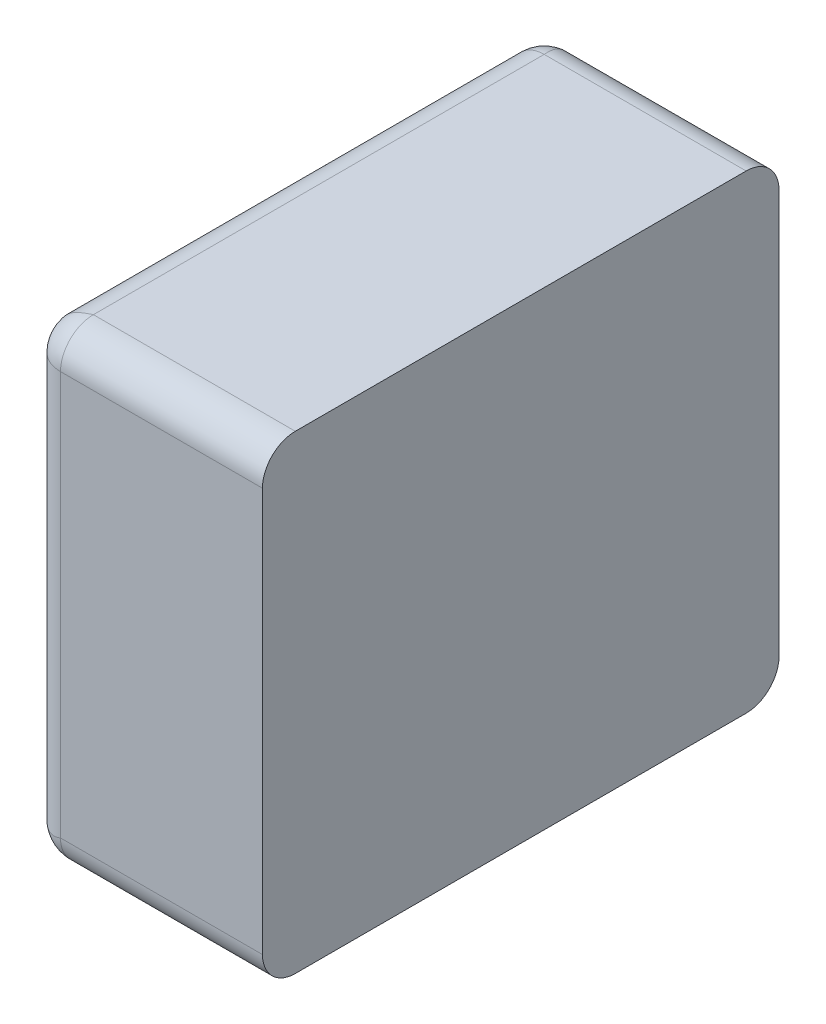
ISO-10303-21;
HEADER;
FILE_DESCRIPTION(('STEP AP214'),'2;1');
FILE_NAME('part.step','',(''),(''),'','','');
FILE_SCHEMA(('AUTOMOTIVE_DESIGN { 1 0 10303 214 1 1 1 1 }'));
ENDSEC;
DATA;
#1=APPLICATION_CONTEXT('core data for automotive mechanical design processes');
#2=APPLICATION_PROTOCOL_DEFINITION('international standard','automotive_design',2000,#1);
#3=PRODUCT_CONTEXT('',#1,'mechanical');
#4=PRODUCT('Part','Part','',(#3));
#5=PRODUCT_RELATED_PRODUCT_CATEGORY('part','',(#4));
#6=PRODUCT_DEFINITION_FORMATION('','',#4);
#7=PRODUCT_DEFINITION_CONTEXT('part definition',#1,'design');
#8=PRODUCT_DEFINITION('design','',#6,#7);
#9=PRODUCT_DEFINITION_SHAPE('','',#8);
#10=(LENGTH_UNIT() NAMED_UNIT(*) SI_UNIT(.MILLI.,.METRE.));
#11=(NAMED_UNIT(*) PLANE_ANGLE_UNIT() SI_UNIT($,.RADIAN.));
#12=(NAMED_UNIT(*) SI_UNIT($,.STERADIAN.) SOLID_ANGLE_UNIT());
#13=UNCERTAINTY_MEASURE_WITH_UNIT(LENGTH_MEASURE(1.E-05),#10,'distance_accuracy_value','');
#14=(GEOMETRIC_REPRESENTATION_CONTEXT(3) GLOBAL_UNCERTAINTY_ASSIGNED_CONTEXT((#13)) GLOBAL_UNIT_ASSIGNED_CONTEXT((#10,
#11,#12)) REPRESENTATION_CONTEXT('',''));
#15=CARTESIAN_POINT('',(0.,0.,0.));
#16=DIRECTION('',(0.,0.,1.));
#17=DIRECTION('',(1.,0.,0.));
#18=AXIS2_PLACEMENT_3D('',#15,#16,#17);
#19=CARTESIAN_POINT('',(-0.465,-0.215,0.035));
#20=DIRECTION('',(0.408248290463862,0.408248290463862,-0.816496580927727));
#21=DIRECTION('',(-0.577350269189627,-0.577350269189626,-0.577350269189624));
#22=AXIS2_PLACEMENT_3D('',#19,#20,#21);
#23=SPHERICAL_SURFACE('',#22,0.035);
#24=CARTESIAN_POINT('',(-0.465,-0.215,0.035));
#25=DIRECTION('',(0.,0.,-1.));
#26=DIRECTION('',(-1.,0.,0.));
#27=AXIS2_PLACEMENT_3D('',#24,#25,#26);
#28=CIRCLE('',#27,0.035);
#29=CARTESIAN_POINT('',(-0.465,-0.25,0.035));
#30=VERTEX_POINT('',#29);
#31=CARTESIAN_POINT('',(-0.5,-0.215,0.035));
#32=VERTEX_POINT('',#31);
#33=EDGE_CURVE('E11',#30,#32,#28,.T.);
#34=ORIENTED_EDGE('',*,*,#33,.T.);
#35=CARTESIAN_POINT('',(-0.465,-0.215,0.035));
#36=DIRECTION('',(0.,-1.,0.));
#37=DIRECTION('',(0.,0.,-1.));
#38=AXIS2_PLACEMENT_3D('',#35,#36,#37);
#39=CIRCLE('',#38,0.035);
#40=CARTESIAN_POINT('',(-0.465,-0.215,0.));
#41=VERTEX_POINT('',#40);
#42=EDGE_CURVE('E25',#32,#41,#39,.T.);
#43=ORIENTED_EDGE('',*,*,#42,.T.);
#44=CARTESIAN_POINT('',(-0.465,-0.215,0.));
#45=CARTESIAN_POINT('',(-0.465111612711924,-0.215243740660052,-1.03313121788324E-09));
#46=CARTESIAN_POINT('',(-0.465220629481718,-0.215488666732516,3.07994713752404E-06));
#47=CARTESIAN_POINT('',(-0.465433885748775,-0.215981520070315,1.54213448005007E-05));
#48=CARTESIAN_POINT('',(-0.465538105940278,-0.216229455116116,2.47047353632996E-05));
#49=CARTESIAN_POINT('',(-0.465741732728677,-0.216728068059787,4.95126755131809E-05));
#50=CARTESIAN_POINT('',(-0.465841119852847,-0.216978752749827,6.5060450524553E-05));
#51=CARTESIAN_POINT('',(-0.466035053958947,-0.217482605532488,0.000102452445534109));
#52=CARTESIAN_POINT('',(-0.466129581379983,-0.217735779413988,0.000124320072643491));
#53=CARTESIAN_POINT('',(-0.466313776392918,-0.218244348899178,0.00017440254172946));
#54=CARTESIAN_POINT('',(-0.466403424402808,-0.218499749275707,0.000202640909732528));
#55=CARTESIAN_POINT('',(-0.466577848292495,-0.219012507395305,0.000265510172820462));
#56=CARTESIAN_POINT('',(-0.466662604636929,-0.219269868886962,0.000300164647462443));
#57=CARTESIAN_POINT('',(-0.466827241108787,-0.219786286919367,0.000375907162554592));
#58=CARTESIAN_POINT('',(-0.466907101816688,-0.220045346199856,0.000417018776369786));
#59=CARTESIAN_POINT('',(-0.467061947217244,-0.220564882823023,0.000505707891539696));
#60=CARTESIAN_POINT('',(-0.467136912658727,-0.220825361855251,0.000553308885241232));
#61=CARTESIAN_POINT('',(-0.467354908381942,-0.221609968604591,0.000706139736048346));
#62=CARTESIAN_POINT('',(-0.467490140608452,-0.222134442299266,0.000820984013978112));
#63=CARTESIAN_POINT('',(-0.467741374273634,-0.223185841676211,0.0010767387258538));
#64=CARTESIAN_POINT('',(-0.467857228778892,-0.223712757469804,0.00121783256577717));
#65=CARTESIAN_POINT('',(-0.468070002263369,-0.224766949596737,0.00152617607159482));
#66=CARTESIAN_POINT('',(-0.468166781309575,-0.225294202048866,0.00169360392114075));
#67=CARTESIAN_POINT('',(-0.468341794125163,-0.226346926690304,0.00205460359238605));
#68=CARTESIAN_POINT('',(-0.468419896278803,-0.226872361926918,0.00224834669154829));
#69=CARTESIAN_POINT('',(-0.468558060079502,-0.227919345661508,0.00266187397459508));
#70=CARTESIAN_POINT('',(-0.468617999653095,-0.228440845843563,0.00288182110244223));
#71=CARTESIAN_POINT('',(-0.468720448187068,-0.229477876626666,0.00334755767046511));
#72=CARTESIAN_POINT('',(-0.468762845535282,-0.229993349320268,0.00359350045178805));
#73=CARTESIAN_POINT('',(-0.468830922361839,-0.231016280639682,0.00411093349099743));
#74=CARTESIAN_POINT('',(-0.468856501350634,-0.23152367372897,0.00438256641507604));
#75=CARTESIAN_POINT('',(-0.468891752157373,-0.232528447342334,0.00495098793051568));
#76=CARTESIAN_POINT('',(-0.468901334999283,-0.233025756761079,0.00524790763666658));
#77=CARTESIAN_POINT('',(-0.468905497314477,-0.234008419811665,0.00586641376765002));
#78=CARTESIAN_POINT('',(-0.468899999455456,-0.234493698895198,0.00618811908026279));
#79=CARTESIAN_POINT('',(-0.468874991771525,-0.235450421844009,0.00685561052472573));
#80=CARTESIAN_POINT('',(-0.468855416137075,-0.235921789865429,0.00720150284269199));
#81=CARTESIAN_POINT('',(-0.468803325972781,-0.236848883390665,0.00791668610202663));
#82=CARTESIAN_POINT('',(-0.468770756798167,-0.237304533887315,0.00828607025275676));
#83=CARTESIAN_POINT('',(-0.468693827906318,-0.238198465147439,0.00904745977856767));
#84=CARTESIAN_POINT('',(-0.468649424130771,-0.238636673823173,0.0094395453073941));
#85=CARTESIAN_POINT('',(-0.468550042880493,-0.239494081877566,0.0102454665261899));
#86=CARTESIAN_POINT('',(-0.46849503115435,-0.239913214090433,0.010659369426859));
#87=CARTESIAN_POINT('',(-0.468375712170395,-0.240730924439449,0.0115079626417149));
#88=CARTESIAN_POINT('',(-0.468311379508136,-0.24112944222653,0.0119427075214746));
#89=CARTESIAN_POINT('',(-0.468174750640235,-0.241904480393031,0.0128319326780499));
#90=CARTESIAN_POINT('',(-0.468102436759082,-0.242280949002712,0.0132864553513876));
#91=CARTESIAN_POINT('',(-0.467951223461324,-0.243010553093937,0.0142140976534304));
#92=CARTESIAN_POINT('',(-0.467872312845424,-0.243363646993975,0.0146872481556479));
#93=CARTESIAN_POINT('',(-0.467709322047743,-0.24404527918449,0.0156509245104299));
#94=CARTESIAN_POINT('',(-0.467625235779704,-0.244373787518085,0.0161414705203753));
#95=CARTESIAN_POINT('',(-0.46745333933637,-0.245005144400936,0.0171386367904849));
#96=CARTESIAN_POINT('',(-0.46736552673908,-0.245307975865549,0.017645267449571));
#97=CARTESIAN_POINT('',(-0.467187644541206,-0.245886997623915,0.0186732264837271));
#98=CARTESIAN_POINT('',(-0.46709757467388,-0.246163184750225,0.0191945565967516));
#99=CARTESIAN_POINT('',(-0.466916657514606,-0.246688063108948,0.0202504670074886));
#100=CARTESIAN_POINT('',(-0.466825810567597,-0.246936765921816,0.020785041607539));
#101=CARTESIAN_POINT('',(-0.466644822850269,-0.247405950840186,0.0218659272634811));
#102=CARTESIAN_POINT('',(-0.466554681484352,-0.247626459881027,0.0224122265262787));
#103=CARTESIAN_POINT('',(-0.466376583863148,-0.248038664969825,0.0235149867097744));
#104=CARTESIAN_POINT('',(-0.466288624536903,-0.248230403683926,0.0240714311827869));
#105=CARTESIAN_POINT('',(-0.466116356585997,-0.248584610279058,0.0251928514102044));
#106=CARTESIAN_POINT('',(-0.466032040923638,-0.248747136696717,0.0257578075882802));
#107=CARTESIAN_POINT('',(-0.465868503907326,-0.249042596740997,0.0268945709012228));
#108=CARTESIAN_POINT('',(-0.465789270127003,-0.249175604674644,0.0274663569255934));
#109=CARTESIAN_POINT('',(-0.465637310030175,-0.249411841774386,0.0286150561499456));
#110=CARTESIAN_POINT('',(-0.465564564571695,-0.249515160678849,0.0291919483482462));
#111=CARTESIAN_POINT('',(-0.465426955223335,-0.24969197165179,0.030349097243533));
#112=CARTESIAN_POINT('',(-0.46536206427015,-0.249765568305483,0.0309293347257463));
#113=CARTESIAN_POINT('',(-0.465241491601007,-0.249883016607641,0.0320913854999231));
#114=CARTESIAN_POINT('',(-0.465185773836936,-0.249926986895526,0.0326731830258738));
#115=CARTESIAN_POINT('',(-0.46508481781809,-0.249985419922284,0.0338365222126201));
#116=CARTESIAN_POINT('',(-0.465039533648617,-0.250000014219777,0.034418053300633));
#117=CARTESIAN_POINT('',(-0.465,-0.25,0.035));
#118=B_SPLINE_CURVE_WITH_KNOTS('',3,(#44,#45,#46,#47,#48,#49,#50,#51,#52,#53,#54,#55,#56,#57,
#58,#59,#60,#61,#62,#63,#64,#65,#66,#67,#68,#69,#70,#71,#72,#73,#74,#75,#76,#77,#78,#79,#80,#81,
#82,#83,#84,#85,#86,#87,#88,#89,#90,#91,#92,#93,#94,#95,#96,#97,#98,#99,#100,#101,#102,#103,
#104,#105,#106,#107,#108,#109,#110,#111,#112,#113,#114,#115,#116,#117),.UNSPECIFIED.,.F.,.F.,(4,
2,2,2,2,2,2,2,2,2,2,2,2,2,2,2,2,2,2,2,2,2,2,2,2,2,2,2,2,2,2,2,2,2,2,2,4),(0.,
0.000804202894423743,0.00161140112012554,0.00242162001218123,0.00323487907148141,
0.00405119199335701,0.00487056670714094,0.00569300542608973,0.00651850470709532,
0.0081784637161977,0.00985048891785636,0.0115343571056827,0.0132297631362427,0.0149363236396878,
0.0166535810697015,0.0183810080428296,0.0201180119227882,0.0218639396106708,0.0236180825069812,
0.0253796816160158,0.027147932767272,0.0289219919322403,0.0307009806181439,0.0324839913229419,
0.034270093038217,0.0360583367884569,0.0378477611967303,0.0396373980678723,0.041426277981054,
0.0432134358840201,0.0449979166813543,0.0467787808088675,0.0485551097856008,0.0503260117339757,
0.0520906268573044,0.0538481328621556,0.0555977503109577),.UNSPECIFIED.);
#119=EDGE_CURVE('E108',#41,#30,#118,.T.);
#120=ORIENTED_EDGE('',*,*,#119,.T.);
#121=EDGE_LOOP('',(#34,#43,#120));
#122=FACE_BOUND('',#121,.T.);
#123=ADVANCED_FACE('F17',(#122),#23,.T.);
#124=CARTESIAN_POINT('',(-0.465,0.215,0.035));
#125=DIRECTION('',(0.408248290463863,-0.408248290463862,-0.816496580927727));
#126=DIRECTION('',(-0.577350269189628,0.577350269189625,-0.577350269189625));
#127=AXIS2_PLACEMENT_3D('',#124,#125,#126);
#128=SPHERICAL_SURFACE('',#127,0.035);
#129=CARTESIAN_POINT('',(-0.465,0.215,0.035));
#130=DIRECTION('',(0.,0.,-1.));
#131=DIRECTION('',(0.,1.,0.));
#132=AXIS2_PLACEMENT_3D('',#129,#130,#131);
#133=CIRCLE('',#132,0.035);
#134=CARTESIAN_POINT('',(-0.5,0.215,0.035));
#135=VERTEX_POINT('',#134);
#136=CARTESIAN_POINT('',(-0.465,0.25,0.035));
#137=VERTEX_POINT('',#136);
#138=EDGE_CURVE('E303',#135,#137,#133,.T.);
#139=ORIENTED_EDGE('',*,*,#138,.T.);
#140=CARTESIAN_POINT('',(-0.465,0.25,0.035));
#141=CARTESIAN_POINT('',(-0.465039533648617,0.250000014219777,0.034418053300633));
#142=CARTESIAN_POINT('',(-0.46508481781809,0.249985419922284,0.0338365222126201));
#143=CARTESIAN_POINT('',(-0.465185773836936,0.249926986895526,0.0326731830258739));
#144=CARTESIAN_POINT('',(-0.465241491601008,0.249883016607641,0.0320913854999232));
#145=CARTESIAN_POINT('',(-0.465362064270151,0.249765568305483,0.0309293347257464));
#146=CARTESIAN_POINT('',(-0.465426955223335,0.24969197165179,0.0303490972435331));
#147=CARTESIAN_POINT('',(-0.465564564571695,0.249515160678849,0.0291919483482462));
#148=CARTESIAN_POINT('',(-0.465637310030175,0.249411841774386,0.0286150561499456));
#149=CARTESIAN_POINT('',(-0.465789270127004,0.249175604674644,0.0274663569255934));
#150=CARTESIAN_POINT('',(-0.465868503907326,0.249042596740997,0.0268945709012228));
#151=CARTESIAN_POINT('',(-0.466032040923638,0.248747136696717,0.0257578075882802));
#152=CARTESIAN_POINT('',(-0.466116356585997,0.248584610279058,0.0251928514102044));
#153=CARTESIAN_POINT('',(-0.466288624536903,0.248230403683926,0.0240714311827869));
#154=CARTESIAN_POINT('',(-0.466376583863148,0.248038664969825,0.0235149867097744));
#155=CARTESIAN_POINT('',(-0.466554681484352,0.247626459881026,0.0224122265262787));
#156=CARTESIAN_POINT('',(-0.466644822850269,0.247405950840186,0.0218659272634811));
#157=CARTESIAN_POINT('',(-0.466825810567597,0.246936765921816,0.020785041607539));
#158=CARTESIAN_POINT('',(-0.466916657514606,0.246688063108949,0.0202504670074887));
#159=CARTESIAN_POINT('',(-0.46709757467388,0.246163184750225,0.0191945565967516));
#160=CARTESIAN_POINT('',(-0.467187644541206,0.245886997623915,0.0186732264837271));
#161=CARTESIAN_POINT('',(-0.46736552673908,0.245307975865549,0.0176452674495711));
#162=CARTESIAN_POINT('',(-0.46745333933637,0.245005144400936,0.0171386367904849));
#163=CARTESIAN_POINT('',(-0.467625235779704,0.244373787518085,0.0161414705203753));
#164=CARTESIAN_POINT('',(-0.467709322047744,0.24404527918449,0.0156509245104299));
#165=CARTESIAN_POINT('',(-0.467872312845424,0.243363646993975,0.0146872481556479));
#166=CARTESIAN_POINT('',(-0.467951223461324,0.243010553093937,0.0142140976534304));
#167=CARTESIAN_POINT('',(-0.468102436759082,0.242280949002712,0.0132864553513876));
#168=CARTESIAN_POINT('',(-0.468174750640235,0.241904480393031,0.0128319326780499));
#169=CARTESIAN_POINT('',(-0.468311379508136,0.24112944222653,0.0119427075214746));
#170=CARTESIAN_POINT('',(-0.468375712170396,0.240730924439448,0.0115079626417148));
#171=CARTESIAN_POINT('',(-0.46849503115435,0.239913214090433,0.010659369426859));
#172=CARTESIAN_POINT('',(-0.468550042880493,0.239494081877566,0.0102454665261898));
#173=CARTESIAN_POINT('',(-0.468649424130772,0.238636673823173,0.00943954530739408));
#174=CARTESIAN_POINT('',(-0.468693827906318,0.238198465147439,0.00904745977856765));
#175=CARTESIAN_POINT('',(-0.468770756798168,0.237304533887315,0.00828607025275674));
#176=CARTESIAN_POINT('',(-0.468803325972781,0.236848883390665,0.00791668610202661));
#177=CARTESIAN_POINT('',(-0.468855416137075,0.235921789865429,0.00720150284269198));
#178=CARTESIAN_POINT('',(-0.468874991771525,0.235450421844009,0.00685561052472571));
#179=CARTESIAN_POINT('',(-0.468899999455456,0.234493698895198,0.00618811908026278));
#180=CARTESIAN_POINT('',(-0.468905497314477,0.234008419811665,0.00586641376765001));
#181=CARTESIAN_POINT('',(-0.468901334999283,0.233025756761079,0.00524790763666659));
#182=CARTESIAN_POINT('',(-0.468891752157373,0.232528447342334,0.0049509879305157));
#183=CARTESIAN_POINT('',(-0.468856501350634,0.23152367372897,0.00438256641507606));
#184=CARTESIAN_POINT('',(-0.468830922361839,0.231016280639683,0.00411093349099744));
#185=CARTESIAN_POINT('',(-0.468762845535282,0.229993349320268,0.00359350045178806));
#186=CARTESIAN_POINT('',(-0.468720448187068,0.229477876626666,0.00334755767046512));
#187=CARTESIAN_POINT('',(-0.468617999653095,0.228440845843563,0.00288182110244223));
#188=CARTESIAN_POINT('',(-0.468558060079502,0.227919345661508,0.00266187397459508));
#189=CARTESIAN_POINT('',(-0.468419896278803,0.226872361926918,0.00224834669154829));
#190=CARTESIAN_POINT('',(-0.468341794125163,0.226346926690304,0.00205460359238605));
#191=CARTESIAN_POINT('',(-0.468166781309575,0.225294202048866,0.00169360392114074));
#192=CARTESIAN_POINT('',(-0.468070002263369,0.224766949596737,0.0015261760715948));
#193=CARTESIAN_POINT('',(-0.467857228778892,0.223712757469804,0.00121783256577715));
#194=CARTESIAN_POINT('',(-0.467741374273634,0.223185841676211,0.0010767387258538));
#195=CARTESIAN_POINT('',(-0.467490140608452,0.222134442299266,0.000820984013978118));
#196=CARTESIAN_POINT('',(-0.467354908381942,0.221609968604591,0.000706139736048343));
#197=CARTESIAN_POINT('',(-0.467136912658727,0.220825361855251,0.000553308885241231));
#198=CARTESIAN_POINT('',(-0.467061947217244,0.220564882823023,0.000505707891539698));
#199=CARTESIAN_POINT('',(-0.466907101816688,0.220045346199856,0.000417018776369788));
#200=CARTESIAN_POINT('',(-0.466827241108787,0.219786286919367,0.000375907162554591));
#201=CARTESIAN_POINT('',(-0.466662604636929,0.219269868886962,0.000300164647462441));
#202=CARTESIAN_POINT('',(-0.466577848292495,0.219012507395305,0.000265510172820461));
#203=CARTESIAN_POINT('',(-0.466403424402808,0.218499749275707,0.000202640909732528));
#204=CARTESIAN_POINT('',(-0.466313776392918,0.218244348899178,0.000174402541729461));
#205=CARTESIAN_POINT('',(-0.466129581379983,0.217735779413988,0.000124320072643491));
#206=CARTESIAN_POINT('',(-0.466035053958947,0.217482605532488,0.000102452445534108));
#207=CARTESIAN_POINT('',(-0.465841119852847,0.216978752749827,6.50604505245525E-05));
#208=CARTESIAN_POINT('',(-0.465741732728677,0.216728068059787,4.9512675513182E-05));
#209=CARTESIAN_POINT('',(-0.465538105940278,0.216229455116116,2.47047353632983E-05));
#210=CARTESIAN_POINT('',(-0.465433885748775,0.215981520070315,1.54213448004956E-05));
#211=CARTESIAN_POINT('',(-0.465220629481718,0.215488666732516,3.07994713751589E-06));
#212=CARTESIAN_POINT('',(-0.465111612711924,0.215243740660052,-1.03313122539466E-09));
#213=CARTESIAN_POINT('',(-0.465,0.215,0.));
#214=B_SPLINE_CURVE_WITH_KNOTS('',3,(#140,#141,#142,#143,#144,#145,#146,#147,#148,#149,#150,
#151,#152,#153,#154,#155,#156,#157,#158,#159,#160,#161,#162,#163,#164,#165,#166,#167,#168,#169,
#170,#171,#172,#173,#174,#175,#176,#177,#178,#179,#180,#181,#182,#183,#184,#185,#186,#187,#188,
#189,#190,#191,#192,#193,#194,#195,#196,#197,#198,#199,#200,#201,#202,#203,#204,#205,#206,#207,
#208,#209,#210,#211,#212,#213),.UNSPECIFIED.,.F.,.F.,(4,2,2,2,2,2,2,2,2,2,2,2,2,2,2,2,2,2,2,2,2,
2,2,2,2,2,2,2,2,2,2,2,2,2,2,2,4),(0.,0.00174961744880199,0.00350712345365322,0.0052717385769819,
0.00704264052535691,0.00881896950209018,0.0105998336296034,0.0123843144269376,
0.0141714723299037,0.0159603522430853,0.0177499891142273,0.0195394135225007,0.0213276572727407,
0.0231137589880158,0.0248967696928138,0.0266757583787174,0.0284498175436857,0.0302180686949419,
0.0319796678039765,0.0337338107002869,0.0354797383881695,0.037216742268128,0.0389441692412561,
0.0406614266712698,0.042367987174715,0.044063393205275,0.0457472613931014,0.04741928659476,
0.0490792456038624,0.049904744884868,0.0507271836038167,0.0515465583176006,0.0523628712394762,
0.0531761302987764,0.0539863491908321,0.0547935474165339,0.0555977503109577),.UNSPECIFIED.);
#215=CARTESIAN_POINT('',(-0.465,0.215,0.));
#216=VERTEX_POINT('',#215);
#217=EDGE_CURVE('E287',#137,#216,#214,.T.);
#218=ORIENTED_EDGE('',*,*,#217,.T.);
#219=CARTESIAN_POINT('',(-0.465,0.215,0.035));
#220=DIRECTION('',(0.,1.,0.));
#221=DIRECTION('',(-1.,0.,0.));
#222=AXIS2_PLACEMENT_3D('',#219,#220,#221);
#223=CIRCLE('',#222,0.0350000000000001);
#224=EDGE_CURVE('E277',#216,#135,#223,.T.);
#225=ORIENTED_EDGE('',*,*,#224,.T.);
#226=EDGE_LOOP('',(#139,#218,#225));
#227=FACE_BOUND('',#226,.T.);
#228=ADVANCED_FACE('F269',(#227),#128,.T.);
#229=CARTESIAN_POINT('',(-0.3125,0.215,0.035));
#230=DIRECTION('',(-1.,0.,0.));
#231=DIRECTION('',(0.,0.707106781186548,-0.707106781186547));
#232=AXIS2_PLACEMENT_3D('',#229,#230,#231);
#233=CYLINDRICAL_SURFACE('',#232,0.035);
#234=CARTESIAN_POINT('',(-0.25,0.215,0.035));
#235=DIRECTION('',(-1.,0.,0.));
#236=DIRECTION('',(0.,0.707106781186548,-0.707106781186547));
#237=AXIS2_PLACEMENT_3D('',#234,#235,#236);
#238=CIRCLE('',#237,0.035);
#239=CARTESIAN_POINT('',(-0.25,0.25,0.035));
#240=VERTEX_POINT('',#239);
#241=CARTESIAN_POINT('',(-0.25,0.215,0.));
#242=VERTEX_POINT('',#241);
#243=EDGE_CURVE('E343',#240,#242,#238,.T.);
#244=ORIENTED_EDGE('',*,*,#243,.T.);
#245=DIRECTION('',(-1.,0.,0.));
#246=VECTOR('',#245,1.);
#247=CARTESIAN_POINT('',(-0.3125,0.215,0.));
#248=LINE('',#247,#246);
#249=EDGE_CURVE('E118',#242,#216,#248,.T.);
#250=ORIENTED_EDGE('',*,*,#249,.T.);
#251=ORIENTED_EDGE('',*,*,#217,.F.);
#252=DIRECTION('',(1.,0.,0.));
#253=VECTOR('',#252,1.);
#254=CARTESIAN_POINT('',(-0.3125,0.25,0.035));
#255=LINE('',#254,#253);
#256=EDGE_CURVE('E340',#137,#240,#255,.T.);
#257=ORIENTED_EDGE('',*,*,#256,.T.);
#258=EDGE_LOOP('',(#244,#250,#251,#257));
#259=FACE_BOUND('',#258,.T.);
#260=ADVANCED_FACE('F265',(#259),#233,.T.);
#261=CARTESIAN_POINT('',(-0.465,0.125,0.035));
#262=DIRECTION('',(0.,-1.,0.));
#263=DIRECTION('',(-0.707106781186549,0.,-0.707106781186546));
#264=AXIS2_PLACEMENT_3D('',#261,#262,#263);
#265=CYLINDRICAL_SURFACE('',#264,0.035);
#266=ORIENTED_EDGE('',*,*,#42,.F.);
#267=DIRECTION('',(0.,1.,0.));
#268=VECTOR('',#267,1.);
#269=CARTESIAN_POINT('',(-0.5,0.125,0.035));
#270=LINE('',#269,#268);
#271=EDGE_CURVE('E345',#32,#135,#270,.T.);
#272=ORIENTED_EDGE('',*,*,#271,.T.);
#273=ORIENTED_EDGE('',*,*,#224,.F.);
#274=DIRECTION('',(0.,-1.,0.));
#275=VECTOR('',#274,1.);
#276=CARTESIAN_POINT('',(-0.465,0.125,0.));
#277=LINE('',#276,#275);
#278=EDGE_CURVE('E348',#216,#41,#277,.T.);
#279=ORIENTED_EDGE('',*,*,#278,.T.);
#280=EDGE_LOOP('',(#266,#272,#273,#279));
#281=FACE_BOUND('',#280,.T.);
#282=ADVANCED_FACE('F261',(#281),#265,.T.);
#283=CARTESIAN_POINT('',(-0.465,-0.215,0.515));
#284=DIRECTION('',(-0.408248290463864,-0.408248290463862,-0.816496580927726));
#285=DIRECTION('',(-0.577350269189626,-0.577350269189625,0.577350269189626));
#286=AXIS2_PLACEMENT_3D('',#283,#284,#285);
#287=SPHERICAL_SURFACE('',#286,0.035);
#288=CARTESIAN_POINT('',(-0.465,-0.215,0.55));
#289=CARTESIAN_POINT('',(-0.465243740660053,-0.215111612711924,0.550000001033131));
#290=CARTESIAN_POINT('',(-0.465488666732516,-0.215220629481718,0.549996920052863));
#291=CARTESIAN_POINT('',(-0.465981520070315,-0.215433885748775,0.5499845786552));
#292=CARTESIAN_POINT('',(-0.466229455116116,-0.215538105940278,0.549975295264637));
#293=CARTESIAN_POINT('',(-0.466728068059787,-0.215741732728677,0.549950487324487));
#294=CARTESIAN_POINT('',(-0.466978752749827,-0.215841119852847,0.549934939549475));
#295=CARTESIAN_POINT('',(-0.467482605532488,-0.216035053958947,0.549897547554466));
#296=CARTESIAN_POINT('',(-0.467735779413988,-0.216129581379983,0.549875679927357));
#297=CARTESIAN_POINT('',(-0.468244348899179,-0.216313776392918,0.549825597458271));
#298=CARTESIAN_POINT('',(-0.468499749275707,-0.216403424402807,0.549797359090268));
#299=CARTESIAN_POINT('',(-0.469012507395305,-0.216577848292495,0.54973448982718));
#300=CARTESIAN_POINT('',(-0.469269868886963,-0.216662604636929,0.549699835352538));
#301=CARTESIAN_POINT('',(-0.469786286919367,-0.216827241108787,0.549624092837446));
#302=CARTESIAN_POINT('',(-0.470045346199856,-0.216907101816688,0.54958298122363));
#303=CARTESIAN_POINT('',(-0.470564882823023,-0.217061947217244,0.54949429210846));
#304=CARTESIAN_POINT('',(-0.470825361855251,-0.217136912658727,0.549446691114759));
#305=CARTESIAN_POINT('',(-0.471609968604591,-0.217354908381942,0.549293860263952));
#306=CARTESIAN_POINT('',(-0.472134442299266,-0.217490140608452,0.549179015986022));
#307=CARTESIAN_POINT('',(-0.473185841676211,-0.217741374273634,0.548923261274146));
#308=CARTESIAN_POINT('',(-0.473712757469804,-0.217857228778892,0.548782167434223));
#309=CARTESIAN_POINT('',(-0.474766949596737,-0.218070002263369,0.548473823928405));
#310=CARTESIAN_POINT('',(-0.475294202048866,-0.218166781309575,0.548306396078859));
#311=CARTESIAN_POINT('',(-0.476346926690304,-0.218341794125163,0.547945396407614));
#312=CARTESIAN_POINT('',(-0.476872361926918,-0.218419896278802,0.547751653308452));
#313=CARTESIAN_POINT('',(-0.477919345661508,-0.218558060079502,0.547338126025405));
#314=CARTESIAN_POINT('',(-0.478440845843563,-0.218617999653095,0.547118178897558));
#315=CARTESIAN_POINT('',(-0.479477876626667,-0.218720448187068,0.546652442329535));
#316=CARTESIAN_POINT('',(-0.479993349320268,-0.218762845535282,0.546406499548212));
#317=CARTESIAN_POINT('',(-0.481016280639683,-0.218830922361839,0.545889066509003));
#318=CARTESIAN_POINT('',(-0.48152367372897,-0.218856501350634,0.545617433584924));
#319=CARTESIAN_POINT('',(-0.482528447342334,-0.218891752157372,0.545049012069484));
#320=CARTESIAN_POINT('',(-0.483025756761079,-0.218901334999283,0.544752092363333));
#321=CARTESIAN_POINT('',(-0.484008419811665,-0.218905497314477,0.54413358623235));
#322=CARTESIAN_POINT('',(-0.484493698895198,-0.218899999455456,0.543811880919737));
#323=CARTESIAN_POINT('',(-0.485450421844009,-0.218874991771525,0.543144389475274));
#324=CARTESIAN_POINT('',(-0.485921789865429,-0.218855416137075,0.542798497157308));
#325=CARTESIAN_POINT('',(-0.486848883390665,-0.218803325972781,0.542083313897973));
#326=CARTESIAN_POINT('',(-0.487304533887315,-0.218770756798167,0.541713929747243));
#327=CARTESIAN_POINT('',(-0.488198465147439,-0.218693827906318,0.540952540221432));
#328=CARTESIAN_POINT('',(-0.488636673823173,-0.218649424130771,0.540560454692606));
#329=CARTESIAN_POINT('',(-0.489494081877566,-0.218550042880493,0.53975453347381));
#330=CARTESIAN_POINT('',(-0.489913214090433,-0.21849503115435,0.539340630573141));
#331=CARTESIAN_POINT('',(-0.490730924439449,-0.218375712170395,0.538492037358285));
#332=CARTESIAN_POINT('',(-0.49112944222653,-0.218311379508136,0.538057292478525));
#333=CARTESIAN_POINT('',(-0.491904480393031,-0.218174750640235,0.53716806732195));
#334=CARTESIAN_POINT('',(-0.492280949002712,-0.218102436759082,0.536713544648613));
#335=CARTESIAN_POINT('',(-0.493010553093937,-0.217951223461324,0.53578590234657));
#336=CARTESIAN_POINT('',(-0.493363646993976,-0.217872312845424,0.535312751844352));
#337=CARTESIAN_POINT('',(-0.49404527918449,-0.217709322047743,0.53434907548957));
#338=CARTESIAN_POINT('',(-0.494373787518085,-0.217625235779704,0.533858529479625));
#339=CARTESIAN_POINT('',(-0.495005144400936,-0.21745333933637,0.532861363209515));
#340=CARTESIAN_POINT('',(-0.495307975865549,-0.21736552673908,0.532354732550429));
#341=CARTESIAN_POINT('',(-0.495886997623915,-0.217187644541206,0.531326773516273));
#342=CARTESIAN_POINT('',(-0.496163184750225,-0.21709757467388,0.530805443403248));
#343=CARTESIAN_POINT('',(-0.496688063108949,-0.216916657514606,0.529749532992511));
#344=CARTESIAN_POINT('',(-0.496936765921816,-0.216825810567597,0.529214958392461));
#345=CARTESIAN_POINT('',(-0.497405950840186,-0.216644822850269,0.528134072736519));
#346=CARTESIAN_POINT('',(-0.497626459881027,-0.216554681484352,0.527587773473721));
#347=CARTESIAN_POINT('',(-0.498038664969825,-0.216376583863148,0.526485013290226));
#348=CARTESIAN_POINT('',(-0.498230403683926,-0.216288624536903,0.525928568817213));
#349=CARTESIAN_POINT('',(-0.498584610279058,-0.216116356585997,0.524807148589796));
#350=CARTESIAN_POINT('',(-0.498747136696717,-0.216032040923638,0.52424219241172));
#351=CARTESIAN_POINT('',(-0.499042596740997,-0.215868503907326,0.523105429098777));
#352=CARTESIAN_POINT('',(-0.499175604674644,-0.215789270127003,0.522533643074407));
#353=CARTESIAN_POINT('',(-0.499411841774386,-0.215637310030175,0.521384943850054));
#354=CARTESIAN_POINT('',(-0.499515160678849,-0.215564564571694,0.520808051651754));
#355=CARTESIAN_POINT('',(-0.49969197165179,-0.215426955223335,0.519650902756467));
#356=CARTESIAN_POINT('',(-0.499765568305483,-0.21536206427015,0.519070665274254));
#357=CARTESIAN_POINT('',(-0.499883016607641,-0.215241491601007,0.517908614500077));
#358=CARTESIAN_POINT('',(-0.499926986895526,-0.215185773836936,0.517326816974126));
#359=CARTESIAN_POINT('',(-0.499985419922284,-0.21508481781809,0.51616347778738));
#360=CARTESIAN_POINT('',(-0.500000014219777,-0.215039533648617,0.515581946699367));
#361=CARTESIAN_POINT('',(-0.5,-0.215,0.515));
#362=B_SPLINE_CURVE_WITH_KNOTS('',3,(#288,#289,#290,#291,#292,#293,#294,#295,#296,#297,#298,
#299,#300,#301,#302,#303,#304,#305,#306,#307,#308,#309,#310,#311,#312,#313,#314,#315,#316,#317,
#318,#319,#320,#321,#322,#323,#324,#325,#326,#327,#328,#329,#330,#331,#332,#333,#334,#335,#336,
#337,#338,#339,#340,#341,#342,#343,#344,#345,#346,#347,#348,#349,#350,#351,#352,#353,#354,#355,
#356,#357,#358,#359,#360,#361),.UNSPECIFIED.,.F.,.F.,(4,2,2,2,2,2,2,2,2,2,2,2,2,2,2,2,2,2,2,2,2,
2,2,2,2,2,2,2,2,2,2,2,2,2,2,2,4),(0.,0.000804202894423778,0.00161140112012553,
0.00242162001218126,0.00323487907148141,0.00405119199335702,0.00487056670714096,
0.00569300542608973,0.00651850470709532,0.00817846371619769,0.00985048891785635,
0.0115343571056827,0.0132297631362427,0.0149363236396878,0.0166535810697015,0.0183810080428297,
0.0201180119227882,0.0218639396106708,0.0236180825069812,0.0253796816160158,0.0271479327672721,
0.0289219919322403,0.0307009806181439,0.0324839913229419,0.034270093038217,0.0360583367884569,
0.0378477611967303,0.0396373980678724,0.041426277981054,0.0432134358840202,0.0449979166813543,
0.0467787808088675,0.0485551097856008,0.0503260117339758,0.0520906268573044,0.0538481328621557,
0.0555977503109577),.UNSPECIFIED.);
#363=CARTESIAN_POINT('',(-0.465,-0.215,0.55));
#364=VERTEX_POINT('',#363);
#365=CARTESIAN_POINT('',(-0.5,-0.215,0.515));
#366=VERTEX_POINT('',#365);
#367=EDGE_CURVE('E235',#364,#366,#362,.T.);
#368=ORIENTED_EDGE('',*,*,#367,.T.);
#369=CARTESIAN_POINT('',(-0.465,-0.215,0.515));
#370=DIRECTION('',(0.,0.,1.));
#371=DIRECTION('',(0.,-1.,0.));
#372=AXIS2_PLACEMENT_3D('',#369,#370,#371);
#373=CIRCLE('',#372,0.035);
#374=CARTESIAN_POINT('',(-0.465,-0.25,0.515));
#375=VERTEX_POINT('',#374);
#376=EDGE_CURVE('E231',#366,#375,#373,.T.);
#377=ORIENTED_EDGE('',*,*,#376,.T.);
#378=CARTESIAN_POINT('',(-0.465,-0.215,0.515));
#379=DIRECTION('',(-1.,0.,0.));
#380=DIRECTION('',(0.,0.,1.));
#381=AXIS2_PLACEMENT_3D('',#378,#379,#380);
#382=CIRCLE('',#381,0.035);
#383=EDGE_CURVE('E226',#375,#364,#382,.T.);
#384=ORIENTED_EDGE('',*,*,#383,.T.);
#385=EDGE_LOOP('',(#368,#377,#384));
#386=FACE_BOUND('',#385,.T.);
#387=ADVANCED_FACE('F251',(#386),#287,.T.);
#388=CARTESIAN_POINT('',(-0.465,-0.215,0.));
#389=DIRECTION('',(0.,0.,1.));
#390=DIRECTION('',(-0.707106781186548,-0.707106781186548,0.));
#391=AXIS2_PLACEMENT_3D('',#388,#389,#390);
#392=CYLINDRICAL_SURFACE('',#391,0.035);
#393=ORIENTED_EDGE('',*,*,#376,.F.);
#394=DIRECTION('',(0.,0.,-1.));
#395=VECTOR('',#394,1.);
#396=CARTESIAN_POINT('',(-0.5,-0.215,0.));
#397=LINE('',#396,#395);
#398=EDGE_CURVE('E222',#366,#32,#397,.T.);
#399=ORIENTED_EDGE('',*,*,#398,.T.);
#400=ORIENTED_EDGE('',*,*,#33,.F.);
#401=DIRECTION('',(0.,0.,1.));
#402=VECTOR('',#401,1.);
#403=CARTESIAN_POINT('',(-0.465,-0.25,0.));
#404=LINE('',#403,#402);
#405=EDGE_CURVE('E218',#30,#375,#404,.T.);
#406=ORIENTED_EDGE('',*,*,#405,.T.);
#407=EDGE_LOOP('',(#393,#399,#400,#406));
#408=FACE_BOUND('',#407,.T.);
#409=ADVANCED_FACE('F260',(#408),#392,.T.);
#410=CARTESIAN_POINT('',(-0.4375,-0.215,0.515));
#411=DIRECTION('',(1.,0.,0.));
#412=DIRECTION('',(0.,-0.707106781186548,0.707106781186548));
#413=AXIS2_PLACEMENT_3D('',#410,#411,#412);
#414=CYLINDRICAL_SURFACE('',#413,0.035);
#415=CARTESIAN_POINT('',(-0.25,-0.215,0.515));
#416=DIRECTION('',(-1.,0.,0.));
#417=DIRECTION('',(0.,-0.707106781186548,0.707106781186548));
#418=AXIS2_PLACEMENT_3D('',#415,#416,#417);
#419=CIRCLE('',#418,0.035);
#420=CARTESIAN_POINT('',(-0.25,-0.25,0.515));
#421=VERTEX_POINT('',#420);
#422=CARTESIAN_POINT('',(-0.25,-0.215,0.55));
#423=VERTEX_POINT('',#422);
#424=EDGE_CURVE('E216',#421,#423,#419,.T.);
#425=ORIENTED_EDGE('',*,*,#424,.T.);
#426=DIRECTION('',(-1.,0.,0.));
#427=VECTOR('',#426,1.);
#428=CARTESIAN_POINT('',(-0.4375,-0.215,0.55));
#429=LINE('',#428,#427);
#430=EDGE_CURVE('E211',#423,#364,#429,.T.);
#431=ORIENTED_EDGE('',*,*,#430,.T.);
#432=ORIENTED_EDGE('',*,*,#383,.F.);
#433=DIRECTION('',(1.,0.,0.));
#434=VECTOR('',#433,1.);
#435=CARTESIAN_POINT('',(-0.4375,-0.25,0.515));
#436=LINE('',#435,#434);
#437=EDGE_CURVE('E208',#375,#421,#436,.T.);
#438=ORIENTED_EDGE('',*,*,#437,.T.);
#439=EDGE_LOOP('',(#425,#431,#432,#438));
#440=FACE_BOUND('',#439,.T.);
#441=ADVANCED_FACE('F191',(#440),#414,.T.);
#442=CARTESIAN_POINT('',(-0.465,0.215,0.515));
#443=DIRECTION('',(-0.408248290463862,-0.816496580927727,0.408248290463863));
#444=DIRECTION('',(-0.577350269189626,0.577350269189625,0.577350269189626));
#445=AXIS2_PLACEMENT_3D('',#442,#443,#444);
#446=SPHERICAL_SURFACE('',#445,0.035);
#447=CARTESIAN_POINT('',(-0.465,0.215,0.515));
#448=DIRECTION('',(-1.,0.,0.));
#449=DIRECTION('',(0.,1.,0.));
#450=AXIS2_PLACEMENT_3D('',#447,#448,#449);
#451=CIRCLE('',#450,0.035);
#452=CARTESIAN_POINT('',(-0.465,0.215,0.55));
#453=VERTEX_POINT('',#452);
#454=CARTESIAN_POINT('',(-0.465,0.25,0.515));
#455=VERTEX_POINT('',#454);
#456=EDGE_CURVE('E206',#453,#455,#451,.T.);
#457=ORIENTED_EDGE('',*,*,#456,.T.);
#458=CARTESIAN_POINT('',(-0.465,0.25,0.515));
#459=CARTESIAN_POINT('',(-0.465243740660053,0.250000001033131,0.515111612711924));
#460=CARTESIAN_POINT('',(-0.465488666732516,0.249996920052863,0.515220629481718));
#461=CARTESIAN_POINT('',(-0.465981520070315,0.2499845786552,0.515433885748775));
#462=CARTESIAN_POINT('',(-0.466229455116116,0.249975295264637,0.515538105940278));
#463=CARTESIAN_POINT('',(-0.466728068059787,0.249950487324487,0.515741732728677));
#464=CARTESIAN_POINT('',(-0.466978752749827,0.249934939549475,0.515841119852847));
#465=CARTESIAN_POINT('',(-0.467482605532488,0.249897547554466,0.516035053958947));
#466=CARTESIAN_POINT('',(-0.467735779413988,0.249875679927356,0.516129581379983));
#467=CARTESIAN_POINT('',(-0.468244348899179,0.249825597458271,0.516313776392918));
#468=CARTESIAN_POINT('',(-0.468499749275707,0.249797359090267,0.516403424402808));
#469=CARTESIAN_POINT('',(-0.469012507395305,0.24973448982718,0.516577848292495));
#470=CARTESIAN_POINT('',(-0.469269868886963,0.249699835352538,0.516662604636929));
#471=CARTESIAN_POINT('',(-0.469786286919367,0.249624092837445,0.516827241108787));
#472=CARTESIAN_POINT('',(-0.470045346199856,0.24958298122363,0.516907101816688));
#473=CARTESIAN_POINT('',(-0.470564882823023,0.24949429210846,0.517061947217244));
#474=CARTESIAN_POINT('',(-0.470825361855251,0.249446691114759,0.517136912658727));
#475=CARTESIAN_POINT('',(-0.471609968604591,0.249293860263952,0.517354908381942));
#476=CARTESIAN_POINT('',(-0.472134442299266,0.249179015986022,0.517490140608452));
#477=CARTESIAN_POINT('',(-0.473185841676211,0.248923261274146,0.517741374273634));
#478=CARTESIAN_POINT('',(-0.473712757469804,0.248782167434223,0.517857228778892));
#479=CARTESIAN_POINT('',(-0.474766949596737,0.248473823928405,0.518070002263369));
#480=CARTESIAN_POINT('',(-0.475294202048866,0.248306396078859,0.518166781309575));
#481=CARTESIAN_POINT('',(-0.476346926690304,0.247945396407614,0.518341794125163));
#482=CARTESIAN_POINT('',(-0.476872361926918,0.247751653308452,0.518419896278803));
#483=CARTESIAN_POINT('',(-0.477919345661508,0.247338126025405,0.518558060079502));
#484=CARTESIAN_POINT('',(-0.478440845843563,0.247118178897558,0.518617999653095));
#485=CARTESIAN_POINT('',(-0.479477876626667,0.246652442329535,0.518720448187068));
#486=CARTESIAN_POINT('',(-0.479993349320268,0.246406499548212,0.518762845535282));
#487=CARTESIAN_POINT('',(-0.481016280639683,0.245889066509003,0.518830922361839));
#488=CARTESIAN_POINT('',(-0.48152367372897,0.245617433584924,0.518856501350634));
#489=CARTESIAN_POINT('',(-0.482528447342334,0.245049012069484,0.518891752157373));
#490=CARTESIAN_POINT('',(-0.483025756761079,0.244752092363333,0.518901334999283));
#491=CARTESIAN_POINT('',(-0.484008419811665,0.24413358623235,0.518905497314477));
#492=CARTESIAN_POINT('',(-0.484493698895198,0.243811880919737,0.518899999455456));
#493=CARTESIAN_POINT('',(-0.485450421844009,0.243144389475274,0.518874991771525));
#494=CARTESIAN_POINT('',(-0.485921789865429,0.242798497157308,0.518855416137075));
#495=CARTESIAN_POINT('',(-0.486848883390665,0.242083313897973,0.518803325972781));
#496=CARTESIAN_POINT('',(-0.487304533887315,0.241713929747243,0.518770756798167));
#497=CARTESIAN_POINT('',(-0.488198465147439,0.240952540221432,0.518693827906318));
#498=CARTESIAN_POINT('',(-0.488636673823173,0.240560454692606,0.518649424130771));
#499=CARTESIAN_POINT('',(-0.489494081877566,0.23975453347381,0.518550042880493));
#500=CARTESIAN_POINT('',(-0.489913214090433,0.239340630573141,0.51849503115435));
#501=CARTESIAN_POINT('',(-0.490730924439449,0.238492037358285,0.518375712170395));
#502=CARTESIAN_POINT('',(-0.49112944222653,0.238057292478525,0.518311379508136));
#503=CARTESIAN_POINT('',(-0.491904480393031,0.23716806732195,0.518174750640235));
#504=CARTESIAN_POINT('',(-0.492280949002712,0.236713544648612,0.518102436759082));
#505=CARTESIAN_POINT('',(-0.493010553093937,0.23578590234657,0.517951223461324));
#506=CARTESIAN_POINT('',(-0.493363646993976,0.235312751844352,0.517872312845424));
#507=CARTESIAN_POINT('',(-0.49404527918449,0.23434907548957,0.517709322047743));
#508=CARTESIAN_POINT('',(-0.494373787518085,0.233858529479625,0.517625235779704));
#509=CARTESIAN_POINT('',(-0.495005144400936,0.232861363209515,0.51745333933637));
#510=CARTESIAN_POINT('',(-0.495307975865549,0.232354732550429,0.51736552673908));
#511=CARTESIAN_POINT('',(-0.495886997623915,0.231326773516273,0.517187644541206));
#512=CARTESIAN_POINT('',(-0.496163184750225,0.230805443403248,0.51709757467388));
#513=CARTESIAN_POINT('',(-0.496688063108949,0.229749532992511,0.516916657514606));
#514=CARTESIAN_POINT('',(-0.496936765921816,0.229214958392461,0.516825810567597));
#515=CARTESIAN_POINT('',(-0.497405950840186,0.228134072736519,0.516644822850269));
#516=CARTESIAN_POINT('',(-0.497626459881027,0.227587773473721,0.516554681484352));
#517=CARTESIAN_POINT('',(-0.498038664969825,0.226485013290226,0.516376583863148));
#518=CARTESIAN_POINT('',(-0.498230403683926,0.225928568817213,0.516288624536903));
#519=CARTESIAN_POINT('',(-0.498584610279058,0.224807148589796,0.516116356585997));
#520=CARTESIAN_POINT('',(-0.498747136696717,0.22424219241172,0.516032040923638));
#521=CARTESIAN_POINT('',(-0.499042596740997,0.223105429098777,0.515868503907326));
#522=CARTESIAN_POINT('',(-0.499175604674644,0.222533643074407,0.515789270127003));
#523=CARTESIAN_POINT('',(-0.499411841774386,0.221384943850054,0.515637310030175));
#524=CARTESIAN_POINT('',(-0.499515160678849,0.220808051651754,0.515564564571695));
#525=CARTESIAN_POINT('',(-0.49969197165179,0.219650902756467,0.515426955223335));
#526=CARTESIAN_POINT('',(-0.499765568305483,0.219070665274254,0.51536206427015));
#527=CARTESIAN_POINT('',(-0.499883016607641,0.217908614500077,0.515241491601007));
#528=CARTESIAN_POINT('',(-0.499926986895526,0.217326816974126,0.515185773836936));
#529=CARTESIAN_POINT('',(-0.499985419922284,0.21616347778738,0.51508481781809));
#530=CARTESIAN_POINT('',(-0.500000014219777,0.215581946699367,0.515039533648617));
#531=CARTESIAN_POINT('',(-0.5,0.215,0.515));
#532=B_SPLINE_CURVE_WITH_KNOTS('',3,(#458,#459,#460,#461,#462,#463,#464,#465,#466,#467,#468,
#469,#470,#471,#472,#473,#474,#475,#476,#477,#478,#479,#480,#481,#482,#483,#484,#485,#486,#487,
#488,#489,#490,#491,#492,#493,#494,#495,#496,#497,#498,#499,#500,#501,#502,#503,#504,#505,#506,
#507,#508,#509,#510,#511,#512,#513,#514,#515,#516,#517,#518,#519,#520,#521,#522,#523,#524,#525,
#526,#527,#528,#529,#530,#531),.UNSPECIFIED.,.F.,.F.,(4,2,2,2,2,2,2,2,2,2,2,2,2,2,2,2,2,2,2,2,2,
2,2,2,2,2,2,2,2,2,2,2,2,2,2,2,4),(0.,0.000804202894423718,0.00161140112012552,
0.00242162001218128,0.00323487907148141,0.00405119199335705,0.00487056670714098,
0.00569300542608973,0.00651850470709533,0.00817846371619769,0.00985048891785633,
0.0115343571056827,0.0132297631362427,0.0149363236396878,0.0166535810697015,0.0183810080428297,
0.0201180119227881,0.0218639396106708,0.0236180825069812,0.0253796816160158,0.027147932767272,
0.0289219919322403,0.0307009806181439,0.0324839913229419,0.034270093038217,0.0360583367884569,
0.0378477611967302,0.0396373980678723,0.041426277981054,0.0432134358840201,0.0449979166813542,
0.0467787808088675,0.0485551097856007,0.0503260117339757,0.0520906268573044,0.0538481328621556,
0.0555977503109576),.UNSPECIFIED.);
#533=CARTESIAN_POINT('',(-0.5,0.215,0.515));
#534=VERTEX_POINT('',#533);
#535=EDGE_CURVE('E166',#455,#534,#532,.T.);
#536=ORIENTED_EDGE('',*,*,#535,.T.);
#537=CARTESIAN_POINT('',(-0.465,0.215,0.515));
#538=DIRECTION('',(0.,1.,0.));
#539=DIRECTION('',(0.,0.,1.));
#540=AXIS2_PLACEMENT_3D('',#537,#538,#539);
#541=CIRCLE('',#540,0.035);
#542=EDGE_CURVE('E161',#534,#453,#541,.T.);
#543=ORIENTED_EDGE('',*,*,#542,.T.);
#544=EDGE_LOOP('',(#457,#536,#543));
#545=FACE_BOUND('',#544,.T.);
#546=ADVANCED_FACE('F184',(#545),#446,.T.);
#547=CARTESIAN_POINT('',(-0.465,0.215,0.));
#548=DIRECTION('',(0.,0.,1.));
#549=DIRECTION('',(-0.707106781186548,0.707106781186547,0.));
#550=AXIS2_PLACEMENT_3D('',#547,#548,#549);
#551=CYLINDRICAL_SURFACE('',#550,0.035);
#552=ORIENTED_EDGE('',*,*,#535,.F.);
#553=DIRECTION('',(0.,0.,-1.));
#554=VECTOR('',#553,1.);
#555=CARTESIAN_POINT('',(-0.465,0.25,0.));
#556=LINE('',#555,#554);
#557=EDGE_CURVE('E156',#455,#137,#556,.T.);
#558=ORIENTED_EDGE('',*,*,#557,.T.);
#559=ORIENTED_EDGE('',*,*,#138,.F.);
#560=DIRECTION('',(0.,0.,1.));
#561=VECTOR('',#560,1.);
#562=CARTESIAN_POINT('',(-0.5,0.215,0.));
#563=LINE('',#562,#561);
#564=EDGE_CURVE('E151',#135,#534,#563,.T.);
#565=ORIENTED_EDGE('',*,*,#564,.T.);
#566=EDGE_LOOP('',(#552,#558,#559,#565));
#567=FACE_BOUND('',#566,.T.);
#568=ADVANCED_FACE('F173',(#567),#551,.T.);
#569=CARTESIAN_POINT('',(-0.465,0.125,0.515));
#570=DIRECTION('',(0.,-1.,0.));
#571=DIRECTION('',(-0.707106781186548,0.,0.707106781186548));
#572=AXIS2_PLACEMENT_3D('',#569,#570,#571);
#573=CYLINDRICAL_SURFACE('',#572,0.035);
#574=ORIENTED_EDGE('',*,*,#367,.F.);
#575=DIRECTION('',(0.,1.,0.));
#576=VECTOR('',#575,1.);
#577=CARTESIAN_POINT('',(-0.465,0.125,0.55));
#578=LINE('',#577,#576);
#579=EDGE_CURVE('E146',#364,#453,#578,.T.);
#580=ORIENTED_EDGE('',*,*,#579,.T.);
#581=ORIENTED_EDGE('',*,*,#542,.F.);
#582=DIRECTION('',(0.,-1.,0.));
#583=VECTOR('',#582,1.);
#584=CARTESIAN_POINT('',(-0.5,0.125,0.515));
#585=LINE('',#584,#583);
#586=EDGE_CURVE('E141',#534,#366,#585,.T.);
#587=ORIENTED_EDGE('',*,*,#586,.T.);
#588=EDGE_LOOP('',(#574,#580,#581,#587));
#589=FACE_BOUND('',#588,.T.);
#590=ADVANCED_FACE('F183',(#589),#573,.T.);
#591=CARTESIAN_POINT('',(-0.3125,0.215,0.515));
#592=DIRECTION('',(-1.,0.,0.));
#593=DIRECTION('',(0.,0.707106781186548,0.707106781186548));
#594=AXIS2_PLACEMENT_3D('',#591,#592,#593);
#595=CYLINDRICAL_SURFACE('',#594,0.035);
#596=CARTESIAN_POINT('',(-0.25,0.215,0.515));
#597=DIRECTION('',(-1.,0.,0.));
#598=DIRECTION('',(0.,0.707106781186548,0.707106781186548));
#599=AXIS2_PLACEMENT_3D('',#596,#597,#598);
#600=CIRCLE('',#599,0.035);
#601=CARTESIAN_POINT('',(-0.25,0.215,0.55));
#602=VERTEX_POINT('',#601);
#603=CARTESIAN_POINT('',(-0.25,0.25,0.515));
#604=VERTEX_POINT('',#603);
#605=EDGE_CURVE('E139',#602,#604,#600,.T.);
#606=ORIENTED_EDGE('',*,*,#605,.T.);
#607=DIRECTION('',(-1.,0.,0.));
#608=VECTOR('',#607,1.);
#609=CARTESIAN_POINT('',(-0.3125,0.25,0.515));
#610=LINE('',#609,#608);
#611=EDGE_CURVE('E134',#604,#455,#610,.T.);
#612=ORIENTED_EDGE('',*,*,#611,.T.);
#613=ORIENTED_EDGE('',*,*,#456,.F.);
#614=DIRECTION('',(1.,0.,0.));
#615=VECTOR('',#614,1.);
#616=CARTESIAN_POINT('',(-0.3125,0.215,0.55));
#617=LINE('',#616,#615);
#618=EDGE_CURVE('E101',#453,#602,#617,.T.);
#619=ORIENTED_EDGE('',*,*,#618,.T.);
#620=EDGE_LOOP('',(#606,#612,#613,#619));
#621=FACE_BOUND('',#620,.T.);
#622=ADVANCED_FACE('F318',(#621),#595,.T.);
#623=CARTESIAN_POINT('',(-0.4375,-0.215,0.035));
#624=DIRECTION('',(1.,0.,0.));
#625=DIRECTION('',(0.,-0.707106781186548,-0.707106781186547));
#626=AXIS2_PLACEMENT_3D('',#623,#624,#625);
#627=CYLINDRICAL_SURFACE('',#626,0.035);
#628=CARTESIAN_POINT('',(-0.25,-0.215,0.035));
#629=DIRECTION('',(-1.,0.,0.));
#630=DIRECTION('',(0.,-0.707106781186548,-0.707106781186547));
#631=AXIS2_PLACEMENT_3D('',#628,#629,#630);
#632=CIRCLE('',#631,0.035);
#633=CARTESIAN_POINT('',(-0.25,-0.215,0.));
#634=VERTEX_POINT('',#633);
#635=CARTESIAN_POINT('',(-0.25,-0.25,0.035));
#636=VERTEX_POINT('',#635);
#637=EDGE_CURVE('E91',#634,#636,#632,.T.);
#638=ORIENTED_EDGE('',*,*,#637,.T.);
#639=DIRECTION('',(-1.,0.,0.));
#640=VECTOR('',#639,1.);
#641=CARTESIAN_POINT('',(-0.4375,-0.25,0.035));
#642=LINE('',#641,#640);
#643=EDGE_CURVE('E102',#636,#30,#642,.T.);
#644=ORIENTED_EDGE('',*,*,#643,.T.);
#645=ORIENTED_EDGE('',*,*,#119,.F.);
#646=DIRECTION('',(1.,0.,0.));
#647=VECTOR('',#646,1.);
#648=CARTESIAN_POINT('',(-0.4375,-0.215,0.));
#649=LINE('',#648,#647);
#650=EDGE_CURVE('E106',#41,#634,#649,.T.);
#651=ORIENTED_EDGE('',*,*,#650,.T.);
#652=EDGE_LOOP('',(#638,#644,#645,#651));
#653=FACE_BOUND('',#652,.T.);
#654=ADVANCED_FACE('F107',(#653),#627,.T.);
#655=CARTESIAN_POINT('',(-0.375,0.,0.55));
#656=DIRECTION('',(0.,0.,1.));
#657=DIRECTION('',(1.,0.,0.));
#658=AXIS2_PLACEMENT_3D('',#655,#656,#657);
#659=PLANE('',#658);
#660=ORIENTED_EDGE('',*,*,#618,.F.);
#661=ORIENTED_EDGE('',*,*,#579,.F.);
#662=ORIENTED_EDGE('',*,*,#430,.F.);
#663=DIRECTION('',(0.,1.,0.));
#664=VECTOR('',#663,1.);
#665=CARTESIAN_POINT('',(-0.25,-0.25,0.55));
#666=LINE('',#665,#664);
#667=EDGE_CURVE('E113',#423,#602,#666,.T.);
#668=ORIENTED_EDGE('',*,*,#667,.T.);
#669=EDGE_LOOP('',(#660,#661,#662,#668));
#670=FACE_BOUND('',#669,.T.);
#671=ADVANCED_FACE('F317',(#670),#659,.T.);
#672=CARTESIAN_POINT('',(-0.5,-0.25,0.));
#673=DIRECTION('',(0.,-1.,0.));
#674=DIRECTION('',(1.,0.,0.));
#675=AXIS2_PLACEMENT_3D('',#672,#673,#674);
#676=PLANE('',#675);
#677=ORIENTED_EDGE('',*,*,#437,.F.);
#678=ORIENTED_EDGE('',*,*,#405,.F.);
#679=ORIENTED_EDGE('',*,*,#643,.F.);
#680=DIRECTION('',(0.,0.,1.));
#681=VECTOR('',#680,1.);
#682=CARTESIAN_POINT('',(-0.25,-0.25,0.));
#683=LINE('',#682,#681);
#684=EDGE_CURVE('E97',#636,#421,#683,.T.);
#685=ORIENTED_EDGE('',*,*,#684,.T.);
#686=EDGE_LOOP('',(#677,#678,#679,#685));
#687=FACE_BOUND('',#686,.T.);
#688=ADVANCED_FACE('F370',(#687),#676,.T.);
#689=CARTESIAN_POINT('',(-0.5,0.25,0.));
#690=DIRECTION('',(-1.,0.,0.));
#691=DIRECTION('',(0.,-1.,0.));
#692=AXIS2_PLACEMENT_3D('',#689,#690,#691);
#693=PLANE('',#692);
#694=ORIENTED_EDGE('',*,*,#271,.F.);
#695=ORIENTED_EDGE('',*,*,#398,.F.);
#696=ORIENTED_EDGE('',*,*,#586,.F.);
#697=ORIENTED_EDGE('',*,*,#564,.F.);
#698=EDGE_LOOP('',(#694,#695,#696,#697));
#699=FACE_BOUND('',#698,.T.);
#700=ADVANCED_FACE('F364',(#699),#693,.T.);
#701=CARTESIAN_POINT('',(-0.25,-0.25,0.));
#702=DIRECTION('',(1.,0.,0.));
#703=DIRECTION('',(0.,1.,0.));
#704=AXIS2_PLACEMENT_3D('',#701,#702,#703);
#705=PLANE('',#704);
#706=ORIENTED_EDGE('',*,*,#605,.F.);
#707=ORIENTED_EDGE('',*,*,#667,.F.);
#708=ORIENTED_EDGE('',*,*,#424,.F.);
#709=ORIENTED_EDGE('',*,*,#684,.F.);
#710=ORIENTED_EDGE('',*,*,#637,.F.);
#711=DIRECTION('',(0.,1.,0.));
#712=VECTOR('',#711,1.);
#713=CARTESIAN_POINT('',(-0.25,-0.25,0.));
#714=LINE('',#713,#712);
#715=EDGE_CURVE('E95',#634,#242,#714,.T.);
#716=ORIENTED_EDGE('',*,*,#715,.T.);
#717=ORIENTED_EDGE('',*,*,#243,.F.);
#718=DIRECTION('',(0.,0.,1.));
#719=VECTOR('',#718,1.);
#720=CARTESIAN_POINT('',(-0.25,0.25,0.));
#721=LINE('',#720,#719);
#722=EDGE_CURVE('E119',#240,#604,#721,.T.);
#723=ORIENTED_EDGE('',*,*,#722,.T.);
#724=EDGE_LOOP('',(#706,#707,#708,#709,#710,#716,#717,#723));
#725=FACE_BOUND('',#724,.T.);
#726=ADVANCED_FACE('F93',(#725),#705,.T.);
#727=CARTESIAN_POINT('',(-0.25,0.25,0.));
#728=DIRECTION('',(0.,1.,0.));
#729=DIRECTION('',(-1.,0.,0.));
#730=AXIS2_PLACEMENT_3D('',#727,#728,#729);
#731=PLANE('',#730);
#732=ORIENTED_EDGE('',*,*,#611,.F.);
#733=ORIENTED_EDGE('',*,*,#722,.F.);
#734=ORIENTED_EDGE('',*,*,#256,.F.);
#735=ORIENTED_EDGE('',*,*,#557,.F.);
#736=EDGE_LOOP('',(#732,#733,#734,#735));
#737=FACE_BOUND('',#736,.T.);
#738=ADVANCED_FACE('F338',(#737),#731,.T.);
#739=CARTESIAN_POINT('',(-0.375,0.,0.));
#740=DIRECTION('',(0.,0.,1.));
#741=DIRECTION('',(1.,0.,0.));
#742=AXIS2_PLACEMENT_3D('',#739,#740,#741);
#743=PLANE('',#742);
#744=ORIENTED_EDGE('',*,*,#249,.F.);
#745=ORIENTED_EDGE('',*,*,#715,.F.);
#746=ORIENTED_EDGE('',*,*,#650,.F.);
#747=ORIENTED_EDGE('',*,*,#278,.F.);
#748=EDGE_LOOP('',(#744,#745,#746,#747));
#749=FACE_BOUND('',#748,.T.);
#750=ADVANCED_FACE('F116',(#749),#743,.F.);
#751=CLOSED_SHELL('',(#123,#228,#260,#282,#387,#409,#441,#546,#568,#590,#622,#654,#671,#688,
#700,#726,#738,#750));
#752=MANIFOLD_SOLID_BREP('B1',#751);
#753=ADVANCED_BREP_SHAPE_REPRESENTATION('',(#18,#752),#14);
#754=SHAPE_DEFINITION_REPRESENTATION(#9,#753);
ENDSEC;
END-ISO-10303-21;
